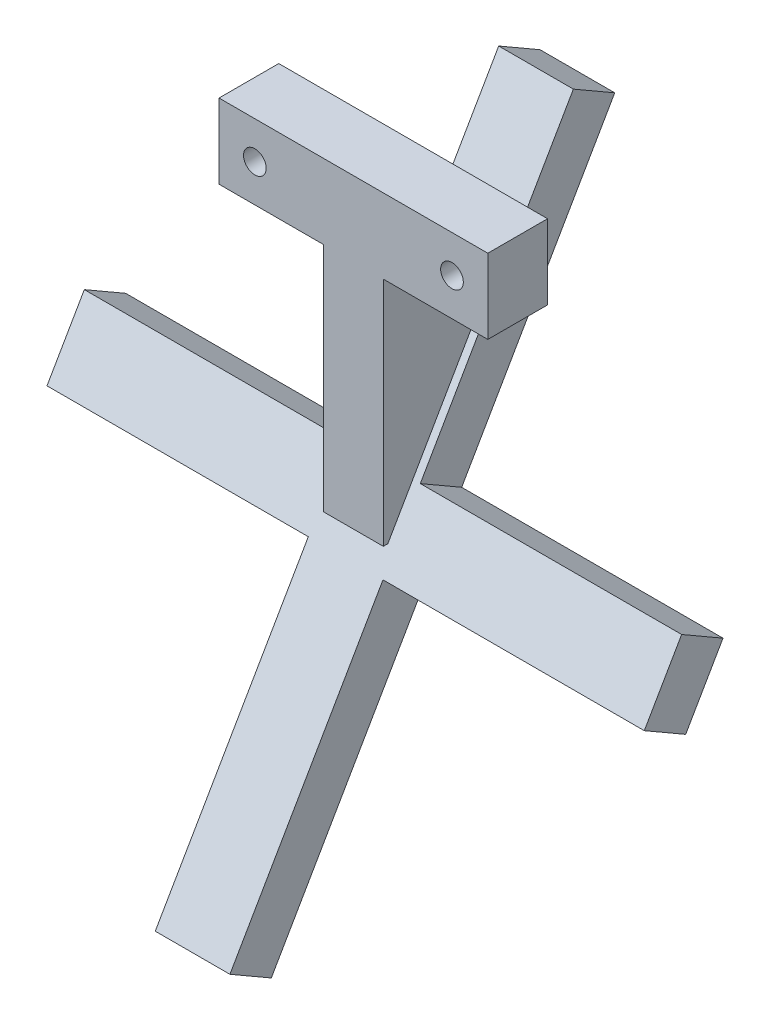
ISO-10303-21;
HEADER;
FILE_DESCRIPTION(('STEP AP214'),'2;1');
FILE_NAME('part.step','',(''),(''),'','','');
FILE_SCHEMA(('AUTOMOTIVE_DESIGN { 1 0 10303 214 1 1 1 1 }'));
ENDSEC;
DATA;
#1=APPLICATION_CONTEXT('core data for automotive mechanical design processes');
#2=APPLICATION_PROTOCOL_DEFINITION('international standard','automotive_design',2000,#1);
#3=PRODUCT_CONTEXT('',#1,'mechanical');
#4=PRODUCT('Part','Part','',(#3));
#5=PRODUCT_RELATED_PRODUCT_CATEGORY('part','',(#4));
#6=PRODUCT_DEFINITION_FORMATION('','',#4);
#7=PRODUCT_DEFINITION_CONTEXT('part definition',#1,'design');
#8=PRODUCT_DEFINITION('design','',#6,#7);
#9=PRODUCT_DEFINITION_SHAPE('','',#8);
#10=(LENGTH_UNIT() NAMED_UNIT(*) SI_UNIT(.MILLI.,.METRE.));
#11=(NAMED_UNIT(*) PLANE_ANGLE_UNIT() SI_UNIT($,.RADIAN.));
#12=(NAMED_UNIT(*) SI_UNIT($,.STERADIAN.) SOLID_ANGLE_UNIT());
#13=UNCERTAINTY_MEASURE_WITH_UNIT(LENGTH_MEASURE(1.E-05),#10,'distance_accuracy_value','');
#14=(GEOMETRIC_REPRESENTATION_CONTEXT(3) GLOBAL_UNCERTAINTY_ASSIGNED_CONTEXT((#13)) GLOBAL_UNIT_ASSIGNED_CONTEXT((#10,
#11,#12)) REPRESENTATION_CONTEXT('',''));
#15=CARTESIAN_POINT('',(0.,0.,0.));
#16=DIRECTION('',(0.,0.,1.));
#17=DIRECTION('',(1.,0.,0.));
#18=AXIS2_PLACEMENT_3D('',#15,#16,#17);
#19=CARTESIAN_POINT('',(-22.5,-6.25,-17.5));
#20=DIRECTION('',(0.,-1.,0.));
#21=DIRECTION('',(0.,0.,-1.));
#22=AXIS2_PLACEMENT_3D('',#19,#20,#21);
#23=PLANE('',#22);
#24=DIRECTION('',(1.,0.,0.));
#25=VECTOR('',#24,1.);
#26=CARTESIAN_POINT('',(-22.5,-6.25,-17.5));
#27=LINE('',#26,#25);
#28=CARTESIAN_POINT('',(-22.5,-6.25,-17.5));
#29=VERTEX_POINT('',#28);
#30=CARTESIAN_POINT('',(-5.,-6.25,-17.5));
#31=VERTEX_POINT('',#30);
#32=EDGE_CURVE('E323',#29,#31,#27,.T.);
#33=ORIENTED_EDGE('',*,*,#32,.T.);
#34=DIRECTION('',(0.,0.,1.));
#35=VECTOR('',#34,1.);
#36=CARTESIAN_POINT('',(-5.,-6.25,-17.5));
#37=LINE('',#36,#35);
#38=CARTESIAN_POINT('',(-5.00000000000001,-6.25,-7.5));
#39=VERTEX_POINT('',#38);
#40=EDGE_CURVE('E260',#31,#39,#37,.T.);
#41=ORIENTED_EDGE('',*,*,#40,.T.);
#42=DIRECTION('',(1.,0.,0.));
#43=VECTOR('',#42,1.);
#44=CARTESIAN_POINT('',(-22.5,-6.25,-7.5));
#45=LINE('',#44,#43);
#46=CARTESIAN_POINT('',(-22.5,-6.25,-7.5));
#47=VERTEX_POINT('',#46);
#48=EDGE_CURVE('E311',#47,#39,#45,.T.);
#49=ORIENTED_EDGE('',*,*,#48,.F.);
#50=DIRECTION('',(0.,0.,-1.));
#51=VECTOR('',#50,1.);
#52=CARTESIAN_POINT('',(-22.5,-6.25,-17.5));
#53=LINE('',#52,#51);
#54=EDGE_CURVE('E294',#47,#29,#53,.T.);
#55=ORIENTED_EDGE('',*,*,#54,.T.);
#56=EDGE_LOOP('',(#33,#41,#49,#55));
#57=FACE_BOUND('',#56,.T.);
#58=ADVANCED_FACE('F39',(#57),#23,.T.);
#59=DIRECTION('',(0.,0.,1.));
#60=VECTOR('',#59,1.);
#61=CARTESIAN_POINT('',(5.,-6.25,-17.5));
#62=LINE('',#61,#60);
#63=CARTESIAN_POINT('',(5.,-6.25,-17.5));
#64=VERTEX_POINT('',#63);
#65=CARTESIAN_POINT('',(5.,-6.25,-7.5));
#66=VERTEX_POINT('',#65);
#67=EDGE_CURVE('E246',#64,#66,#62,.T.);
#68=ORIENTED_EDGE('',*,*,#67,.F.);
#69=CARTESIAN_POINT('',(22.5,-6.25,-17.5));
#70=VERTEX_POINT('',#69);
#71=EDGE_CURVE('E310',#64,#70,#27,.T.);
#72=ORIENTED_EDGE('',*,*,#71,.T.);
#73=DIRECTION('',(0.,0.,-1.));
#74=VECTOR('',#73,1.);
#75=CARTESIAN_POINT('',(22.5,-6.25,-17.5));
#76=LINE('',#75,#74);
#77=CARTESIAN_POINT('',(22.5,-6.25,-7.5));
#78=VERTEX_POINT('',#77);
#79=EDGE_CURVE('E278',#78,#70,#76,.T.);
#80=ORIENTED_EDGE('',*,*,#79,.F.);
#81=EDGE_CURVE('E316',#66,#78,#45,.T.);
#82=ORIENTED_EDGE('',*,*,#81,.F.);
#83=EDGE_LOOP('',(#68,#72,#80,#82));
#84=FACE_BOUND('',#83,.T.);
#85=ADVANCED_FACE('F343',(#84),#23,.T.);
#86=CARTESIAN_POINT('',(-22.5,6.25,-7.5));
#87=DIRECTION('',(0.,0.,1.));
#88=DIRECTION('',(1.,0.,0.));
#89=AXIS2_PLACEMENT_3D('',#86,#87,#88);
#90=PLANE('',#89);
#91=CARTESIAN_POINT('',(-16.5,0.,-7.5));
#92=DIRECTION('',(0.,0.,-1.));
#93=DIRECTION('',(-1.,0.,0.));
#94=AXIS2_PLACEMENT_3D('',#91,#92,#93);
#95=CIRCLE('',#94,1.89864999999999);
#96=CARTESIAN_POINT('',(-18.39865,0.,-7.5));
#97=VERTEX_POINT('',#96);
#98=EDGE_CURVE('E234',#97,#97,#95,.T.);
#99=ORIENTED_EDGE('',*,*,#98,.T.);
#100=EDGE_LOOP('',(#99));
#101=FACE_BOUND('',#100,.T.);
#102=CARTESIAN_POINT('',(16.5,0.,-7.5));
#103=DIRECTION('',(0.,0.,-1.));
#104=DIRECTION('',(-1.,0.,0.));
#105=AXIS2_PLACEMENT_3D('',#102,#103,#104);
#106=CIRCLE('',#105,1.89864999999999);
#107=CARTESIAN_POINT('',(14.60135,0.,-7.5));
#108=VERTEX_POINT('',#107);
#109=EDGE_CURVE('E242',#108,#108,#106,.T.);
#110=ORIENTED_EDGE('',*,*,#109,.T.);
#111=EDGE_LOOP('',(#110));
#112=FACE_BOUND('',#111,.T.);
#113=ORIENTED_EDGE('',*,*,#48,.T.);
#114=DIRECTION('',(0.,-1.,0.));
#115=VECTOR('',#114,1.);
#116=CARTESIAN_POINT('',(-5.,-6.25,-7.5));
#117=LINE('',#116,#115);
#118=CARTESIAN_POINT('',(-5.,-45.,-7.50000000000001));
#119=VERTEX_POINT('',#118);
#120=EDGE_CURVE('E264',#39,#119,#117,.T.);
#121=ORIENTED_EDGE('',*,*,#120,.T.);
#122=DIRECTION('',(1.,0.,0.));
#123=VECTOR('',#122,1.);
#124=CARTESIAN_POINT('',(-5.,-45.,-7.50000000000001));
#125=LINE('',#124,#123);
#126=CARTESIAN_POINT('',(5.,-45.,-7.50000000000001));
#127=VERTEX_POINT('',#126);
#128=EDGE_CURVE('E275',#119,#127,#125,.T.);
#129=ORIENTED_EDGE('',*,*,#128,.T.);
#130=DIRECTION('',(0.,-1.,0.));
#131=VECTOR('',#130,1.);
#132=CARTESIAN_POINT('',(5.,-6.25,-7.5));
#133=LINE('',#132,#131);
#134=EDGE_CURVE('E250',#66,#127,#133,.T.);
#135=ORIENTED_EDGE('',*,*,#134,.F.);
#136=ORIENTED_EDGE('',*,*,#81,.T.);
#137=DIRECTION('',(0.,-1.,0.));
#138=VECTOR('',#137,1.);
#139=CARTESIAN_POINT('',(22.5,6.25,-7.5));
#140=LINE('',#139,#138);
#141=CARTESIAN_POINT('',(22.5,6.25,-7.5));
#142=VERTEX_POINT('',#141);
#143=EDGE_CURVE('E290',#142,#78,#140,.T.);
#144=ORIENTED_EDGE('',*,*,#143,.F.);
#145=DIRECTION('',(1.,0.,0.));
#146=VECTOR('',#145,1.);
#147=CARTESIAN_POINT('',(-22.5,6.25,-7.5));
#148=LINE('',#147,#146);
#149=CARTESIAN_POINT('',(-22.5,6.25,-7.5));
#150=VERTEX_POINT('',#149);
#151=EDGE_CURVE('E317',#150,#142,#148,.T.);
#152=ORIENTED_EDGE('',*,*,#151,.F.);
#153=DIRECTION('',(0.,-1.,0.));
#154=VECTOR('',#153,1.);
#155=CARTESIAN_POINT('',(-22.5,6.25,-7.5));
#156=LINE('',#155,#154);
#157=EDGE_CURVE('E306',#150,#47,#156,.T.);
#158=ORIENTED_EDGE('',*,*,#157,.T.);
#159=EDGE_LOOP('',(#113,#121,#129,#135,#136,#144,#152,#158));
#160=FACE_BOUND('',#159,.T.);
#161=ADVANCED_FACE('F352',(#101,#112,#160),#90,.T.);
#162=CARTESIAN_POINT('',(-22.5,6.25,-17.5));
#163=DIRECTION('',(0.,1.,0.));
#164=DIRECTION('',(0.,0.,1.));
#165=AXIS2_PLACEMENT_3D('',#162,#163,#164);
#166=PLANE('',#165);
#167=ORIENTED_EDGE('',*,*,#151,.T.);
#168=DIRECTION('',(0.,0.,1.));
#169=VECTOR('',#168,1.);
#170=CARTESIAN_POINT('',(22.5,6.25,-17.5));
#171=LINE('',#170,#169);
#172=CARTESIAN_POINT('',(22.5,6.25,-17.5));
#173=VERTEX_POINT('',#172);
#174=EDGE_CURVE('E286',#173,#142,#171,.T.);
#175=ORIENTED_EDGE('',*,*,#174,.F.);
#176=DIRECTION('',(1.,0.,0.));
#177=VECTOR('',#176,1.);
#178=CARTESIAN_POINT('',(-22.5,6.25,-17.5));
#179=LINE('',#178,#177);
#180=CARTESIAN_POINT('',(-22.5,6.25,-17.5));
#181=VERTEX_POINT('',#180);
#182=EDGE_CURVE('E320',#181,#173,#179,.T.);
#183=ORIENTED_EDGE('',*,*,#182,.F.);
#184=DIRECTION('',(0.,0.,1.));
#185=VECTOR('',#184,1.);
#186=CARTESIAN_POINT('',(-22.5,6.25,-17.5));
#187=LINE('',#186,#185);
#188=EDGE_CURVE('E302',#181,#150,#187,.T.);
#189=ORIENTED_EDGE('',*,*,#188,.T.);
#190=EDGE_LOOP('',(#167,#175,#183,#189));
#191=FACE_BOUND('',#190,.T.);
#192=ADVANCED_FACE('F391',(#191),#166,.T.);
#193=CARTESIAN_POINT('',(-22.5,-6.25,-17.5));
#194=DIRECTION('',(0.,0.,-1.));
#195=DIRECTION('',(-1.,0.,0.));
#196=AXIS2_PLACEMENT_3D('',#193,#194,#195);
#197=PLANE('',#196);
#198=DIRECTION('',(0.,1.,0.));
#199=VECTOR('',#198,1.);
#200=CARTESIAN_POINT('',(5.,-6.25,-17.5));
#201=LINE('',#200,#199);
#202=CARTESIAN_POINT('',(5.,-10.3397459621554,-17.5));
#203=VERTEX_POINT('',#202);
#204=EDGE_CURVE('E257',#203,#64,#201,.T.);
#205=ORIENTED_EDGE('',*,*,#204,.F.);
#206=DIRECTION('',(1.,0.,0.));
#207=VECTOR('',#206,1.);
#208=CARTESIAN_POINT('',(-5.,-10.3397459621554,-17.5));
#209=LINE('',#208,#207);
#210=CARTESIAN_POINT('',(-5.,-10.3397459621554,-17.5));
#211=VERTEX_POINT('',#210);
#212=EDGE_CURVE('E61',#203,#211,#209,.F.);
#213=ORIENTED_EDGE('',*,*,#212,.T.);
#214=DIRECTION('',(0.,1.,0.));
#215=VECTOR('',#214,1.);
#216=CARTESIAN_POINT('',(-5.,-6.25,-17.5));
#217=LINE('',#216,#215);
#218=EDGE_CURVE('E272',#211,#31,#217,.T.);
#219=ORIENTED_EDGE('',*,*,#218,.T.);
#220=ORIENTED_EDGE('',*,*,#32,.F.);
#221=DIRECTION('',(0.,1.,0.));
#222=VECTOR('',#221,1.);
#223=CARTESIAN_POINT('',(-22.5,-6.25,-17.5));
#224=LINE('',#223,#222);
#225=EDGE_CURVE('E298',#29,#181,#224,.T.);
#226=ORIENTED_EDGE('',*,*,#225,.T.);
#227=ORIENTED_EDGE('',*,*,#182,.T.);
#228=DIRECTION('',(0.,1.,0.));
#229=VECTOR('',#228,1.);
#230=CARTESIAN_POINT('',(22.5,-6.25,-17.5));
#231=LINE('',#230,#229);
#232=EDGE_CURVE('E282',#70,#173,#231,.T.);
#233=ORIENTED_EDGE('',*,*,#232,.F.);
#234=ORIENTED_EDGE('',*,*,#71,.F.);
#235=EDGE_LOOP('',(#205,#213,#219,#220,#226,#227,#233,#234));
#236=FACE_BOUND('',#235,.T.);
#237=CARTESIAN_POINT('',(-16.5,0.,-17.5));
#238=DIRECTION('',(0.,0.,-1.));
#239=DIRECTION('',(-1.,0.,0.));
#240=AXIS2_PLACEMENT_3D('',#237,#238,#239);
#241=CIRCLE('',#240,1.89864999999999);
#242=CARTESIAN_POINT('',(-18.39865,0.,-17.5));
#243=VERTEX_POINT('',#242);
#244=EDGE_CURVE('E230',#243,#243,#241,.T.);
#245=ORIENTED_EDGE('',*,*,#244,.F.);
#246=EDGE_LOOP('',(#245));
#247=FACE_BOUND('',#246,.T.);
#248=CARTESIAN_POINT('',(16.5,0.,-17.5));
#249=DIRECTION('',(0.,0.,-1.));
#250=DIRECTION('',(-1.,0.,0.));
#251=AXIS2_PLACEMENT_3D('',#248,#249,#250);
#252=CIRCLE('',#251,1.89864999999999);
#253=CARTESIAN_POINT('',(14.60135,0.,-17.5));
#254=VERTEX_POINT('',#253);
#255=EDGE_CURVE('E238',#254,#254,#252,.T.);
#256=ORIENTED_EDGE('',*,*,#255,.F.);
#257=EDGE_LOOP('',(#256));
#258=FACE_BOUND('',#257,.T.);
#259=ADVANCED_FACE('F345',(#236,#247,#258),#197,.T.);
#260=CARTESIAN_POINT('',(-22.5,0.,0.));
#261=DIRECTION('',(1.,0.,0.));
#262=DIRECTION('',(0.,0.,-1.));
#263=AXIS2_PLACEMENT_3D('',#260,#261,#262);
#264=PLANE('',#263);
#265=ORIENTED_EDGE('',*,*,#54,.F.);
#266=ORIENTED_EDGE('',*,*,#157,.F.);
#267=ORIENTED_EDGE('',*,*,#188,.F.);
#268=ORIENTED_EDGE('',*,*,#225,.F.);
#269=EDGE_LOOP('',(#265,#266,#267,#268));
#270=FACE_BOUND('',#269,.T.);
#271=ADVANCED_FACE('F367',(#270),#264,.F.);
#272=CARTESIAN_POINT('',(22.5,0.,0.));
#273=DIRECTION('',(1.,0.,0.));
#274=DIRECTION('',(0.,0.,-1.));
#275=AXIS2_PLACEMENT_3D('',#272,#273,#274);
#276=PLANE('',#275);
#277=ORIENTED_EDGE('',*,*,#79,.T.);
#278=ORIENTED_EDGE('',*,*,#232,.T.);
#279=ORIENTED_EDGE('',*,*,#174,.T.);
#280=ORIENTED_EDGE('',*,*,#143,.T.);
#281=EDGE_LOOP('',(#277,#278,#279,#280));
#282=FACE_BOUND('',#281,.T.);
#283=ADVANCED_FACE('F349',(#282),#276,.T.);
#284=CARTESIAN_POINT('',(-5.,-45.,-7.50000000000001));
#285=DIRECTION('',(0.,-1.,0.));
#286=DIRECTION('',(0.,0.,-1.));
#287=AXIS2_PLACEMENT_3D('',#284,#285,#286);
#288=PLANE('',#287);
#289=DIRECTION('',(-1.,0.,0.));
#290=VECTOR('',#289,1.);
#291=CARTESIAN_POINT('',(-5.,-45.,-8.26239569296598));
#292=LINE('',#291,#290);
#293=CARTESIAN_POINT('',(5.,-45.,-8.26239569296598));
#294=VERTEX_POINT('',#293);
#295=CARTESIAN_POINT('',(-5.,-45.,-8.26239569296598));
#296=VERTEX_POINT('',#295);
#297=EDGE_CURVE('E217',#294,#296,#292,.T.);
#298=ORIENTED_EDGE('',*,*,#297,.F.);
#299=DIRECTION('',(0.,0.,-1.));
#300=VECTOR('',#299,1.);
#301=CARTESIAN_POINT('',(5.,-45.,-7.50000000000001));
#302=LINE('',#301,#300);
#303=EDGE_CURVE('E254',#127,#294,#302,.T.);
#304=ORIENTED_EDGE('',*,*,#303,.F.);
#305=ORIENTED_EDGE('',*,*,#128,.F.);
#306=DIRECTION('',(0.,0.,-1.));
#307=VECTOR('',#306,1.);
#308=CARTESIAN_POINT('',(-5.,-45.,-7.50000000000001));
#309=LINE('',#308,#307);
#310=EDGE_CURVE('E268',#119,#296,#309,.T.);
#311=ORIENTED_EDGE('',*,*,#310,.T.);
#312=EDGE_LOOP('',(#298,#304,#305,#311));
#313=FACE_BOUND('',#312,.T.);
#314=ADVANCED_FACE('F371',(#313),#288,.T.);
#315=CARTESIAN_POINT('',(-5.,0.,0.));
#316=DIRECTION('',(1.,0.,0.));
#317=DIRECTION('',(0.,0.,-1.));
#318=AXIS2_PLACEMENT_3D('',#315,#316,#317);
#319=PLANE('',#318);
#320=ORIENTED_EDGE('',*,*,#218,.F.);
#321=CARTESIAN_POINT('',(-5.,-10.3397459621554,-22.5));
#322=DIRECTION('',(1.,0.,0.));
#323=DIRECTION('',(0.,0.,-1.));
#324=AXIS2_PLACEMENT_3D('',#321,#322,#323);
#325=CIRCLE('',#324,5.);
#326=CARTESIAN_POINT('',(-5.,-12.8397459621554,-26.8301270189222));
#327=VERTEX_POINT('',#326);
#328=EDGE_CURVE('E11',#211,#327,#325,.T.);
#329=ORIENTED_EDGE('',*,*,#328,.T.);
#330=DIRECTION('',(0.,-0.86602540378444,0.499999999999998));
#331=VECTOR('',#330,1.);
#332=CARTESIAN_POINT('',(-5.,-14.8277222831137,-25.6823683548743));
#333=LINE('',#332,#331);
#334=EDGE_CURVE('E222',#327,#296,#333,.T.);
#335=ORIENTED_EDGE('',*,*,#334,.T.);
#336=ORIENTED_EDGE('',*,*,#310,.F.);
#337=ORIENTED_EDGE('',*,*,#120,.F.);
#338=ORIENTED_EDGE('',*,*,#40,.F.);
#339=EDGE_LOOP('',(#320,#329,#335,#336,#337,#338));
#340=FACE_BOUND('',#339,.T.);
#341=ADVANCED_FACE('F359',(#340),#319,.F.);
#342=CARTESIAN_POINT('',(5.,0.,0.));
#343=DIRECTION('',(1.,0.,0.));
#344=DIRECTION('',(0.,0.,-1.));
#345=AXIS2_PLACEMENT_3D('',#342,#343,#344);
#346=PLANE('',#345);
#347=DIRECTION('',(0.,-0.86602540378444,0.499999999999998));
#348=VECTOR('',#347,1.);
#349=CARTESIAN_POINT('',(5.,-14.8277222831137,-25.6823683548743));
#350=LINE('',#349,#348);
#351=CARTESIAN_POINT('',(5.,-12.8397459621554,-26.8301270189222));
#352=VERTEX_POINT('',#351);
#353=EDGE_CURVE('E315',#352,#294,#350,.T.);
#354=ORIENTED_EDGE('',*,*,#353,.F.);
#355=CARTESIAN_POINT('',(5.,-10.3397459621554,-22.5));
#356=DIRECTION('',(1.,0.,0.));
#357=DIRECTION('',(0.,0.,-1.));
#358=AXIS2_PLACEMENT_3D('',#355,#356,#357);
#359=CIRCLE('',#358,5.);
#360=EDGE_CURVE('E48',#352,#203,#359,.F.);
#361=ORIENTED_EDGE('',*,*,#360,.T.);
#362=ORIENTED_EDGE('',*,*,#204,.T.);
#363=ORIENTED_EDGE('',*,*,#67,.T.);
#364=ORIENTED_EDGE('',*,*,#134,.T.);
#365=ORIENTED_EDGE('',*,*,#303,.T.);
#366=EDGE_LOOP('',(#354,#361,#362,#363,#364,#365));
#367=FACE_BOUND('',#366,.T.);
#368=ADVANCED_FACE('F354',(#367),#346,.T.);
#369=CARTESIAN_POINT('',(16.5,0.,-17.5));
#370=DIRECTION('',(0.,0.,-1.));
#371=DIRECTION('',(-1.,0.,0.));
#372=AXIS2_PLACEMENT_3D('',#369,#370,#371);
#373=CYLINDRICAL_SURFACE('',#372,1.89864999999999);
#374=ORIENTED_EDGE('',*,*,#109,.F.);
#375=EDGE_LOOP('',(#374));
#376=FACE_BOUND('',#375,.T.);
#377=ORIENTED_EDGE('',*,*,#255,.T.);
#378=EDGE_LOOP('',(#377));
#379=FACE_BOUND('',#378,.T.);
#380=ADVANCED_FACE('F380',(#376,#379),#373,.F.);
#381=CARTESIAN_POINT('',(-16.5,0.,-17.5));
#382=DIRECTION('',(0.,0.,-1.));
#383=DIRECTION('',(-1.,0.,0.));
#384=AXIS2_PLACEMENT_3D('',#381,#382,#383);
#385=CYLINDRICAL_SURFACE('',#384,1.89864999999999);
#386=ORIENTED_EDGE('',*,*,#98,.F.);
#387=EDGE_LOOP('',(#386));
#388=FACE_BOUND('',#387,.T.);
#389=ORIENTED_EDGE('',*,*,#244,.T.);
#390=EDGE_LOOP('',(#389));
#391=FACE_BOUND('',#390,.T.);
#392=ADVANCED_FACE('F373',(#388,#391),#385,.F.);
#393=CARTESIAN_POINT('',(0.,-14.8277222831137,-25.6823683548743));
#394=DIRECTION('',(0.,0.499999999999998,0.86602540378444));
#395=DIRECTION('',(0.,-0.86602540378444,0.499999999999998));
#396=AXIS2_PLACEMENT_3D('',#393,#394,#395);
#397=PLANE('',#396);
#398=DIRECTION('',(0.,-0.86602540378444,0.499999999999998));
#399=VECTOR('',#398,1.);
#400=CARTESIAN_POINT('',(-6.24999999999999,-48.5777222831139,-6.19679676972449));
#401=LINE('',#400,#399);
#402=CARTESIAN_POINT('',(-6.24999999999999,-48.5777222831139,-6.19679676972449));
#403=VERTEX_POINT('',#402);
#404=CARTESIAN_POINT('',(-6.25000000000001,-92.9615242270664,19.4282032302754));
#405=VERTEX_POINT('',#404);
#406=EDGE_CURVE('E200',#403,#405,#401,.T.);
#407=ORIENTED_EDGE('',*,*,#406,.T.);
#408=DIRECTION('',(1.,0.,0.));
#409=VECTOR('',#408,1.);
#410=CARTESIAN_POINT('',(-6.25000000000001,-92.9615242270664,19.4282032302754));
#411=LINE('',#410,#409);
#412=CARTESIAN_POINT('',(6.25000000000001,-92.9615242270664,19.4282032302754));
#413=VERTEX_POINT('',#412);
#414=EDGE_CURVE('E188',#405,#413,#411,.T.);
#415=ORIENTED_EDGE('',*,*,#414,.T.);
#416=DIRECTION('',(0.,0.86602540378444,-0.499999999999998));
#417=VECTOR('',#416,1.);
#418=CARTESIAN_POINT('',(6.24999999999999,-48.5777222831139,-6.19679676972449));
#419=LINE('',#418,#417);
#420=CARTESIAN_POINT('',(6.24999999999999,-48.5777222831139,-6.19679676972449));
#421=VERTEX_POINT('',#420);
#422=EDGE_CURVE('E199',#413,#421,#419,.T.);
#423=ORIENTED_EDGE('',*,*,#422,.T.);
#424=DIRECTION('',(1.,0.,0.));
#425=VECTOR('',#424,1.);
#426=CARTESIAN_POINT('',(50.,-48.5777222831139,-6.19679676972449));
#427=LINE('',#426,#425);
#428=CARTESIAN_POINT('',(50.,-48.5777222831139,-6.19679676972449));
#429=VERTEX_POINT('',#428);
#430=EDGE_CURVE('E538',#421,#429,#427,.T.);
#431=ORIENTED_EDGE('',*,*,#430,.T.);
#432=DIRECTION('',(0.,0.86602540378444,-0.499999999999998));
#433=VECTOR('',#432,1.);
#434=CARTESIAN_POINT('',(50.,-37.7524047358083,-12.4467967697245));
#435=LINE('',#434,#433);
#436=CARTESIAN_POINT('',(50.,-37.7524047358083,-12.4467967697245));
#437=VERTEX_POINT('',#436);
#438=EDGE_CURVE('E550',#429,#437,#435,.T.);
#439=ORIENTED_EDGE('',*,*,#438,.T.);
#440=DIRECTION('',(-1.,0.,0.));
#441=VECTOR('',#440,1.);
#442=CARTESIAN_POINT('',(50.,-37.7524047358083,-12.4467967697245));
#443=LINE('',#442,#441);
#444=CARTESIAN_POINT('',(6.24999999999999,-37.7524047358083,-12.4467967697245));
#445=VERTEX_POINT('',#444);
#446=EDGE_CURVE('E546',#437,#445,#443,.T.);
#447=ORIENTED_EDGE('',*,*,#446,.T.);
#448=DIRECTION('',(0.,0.86602540378444,-0.499999999999998));
#449=VECTOR('',#448,1.);
#450=CARTESIAN_POINT('',(6.24999999999999,-37.7524047358083,-12.4467967697245));
#451=LINE('',#450,#449);
#452=CARTESIAN_POINT('',(6.25000000000001,6.63139720814417,-38.0717967697244));
#453=VERTEX_POINT('',#452);
#454=EDGE_CURVE('E549',#445,#453,#451,.T.);
#455=ORIENTED_EDGE('',*,*,#454,.T.);
#456=DIRECTION('',(-1.,0.,0.));
#457=VECTOR('',#456,1.);
#458=CARTESIAN_POINT('',(-6.25000000000001,6.63139720814417,-38.0717967697244));
#459=LINE('',#458,#457);
#460=CARTESIAN_POINT('',(-6.25000000000001,6.63139720814417,-38.0717967697244));
#461=VERTEX_POINT('',#460);
#462=EDGE_CURVE('E554',#453,#461,#459,.T.);
#463=ORIENTED_EDGE('',*,*,#462,.T.);
#464=DIRECTION('',(0.,-0.86602540378444,0.499999999999998));
#465=VECTOR('',#464,1.);
#466=CARTESIAN_POINT('',(-6.24999999999999,-37.7524047358083,-12.4467967697245));
#467=LINE('',#466,#465);
#468=CARTESIAN_POINT('',(-6.24999999999999,-37.7524047358083,-12.4467967697245));
#469=VERTEX_POINT('',#468);
#470=EDGE_CURVE('E561',#461,#469,#467,.T.);
#471=ORIENTED_EDGE('',*,*,#470,.T.);
#472=DIRECTION('',(-1.,0.,0.));
#473=VECTOR('',#472,1.);
#474=CARTESIAN_POINT('',(-50.,-37.7524047358083,-12.4467967697245));
#475=LINE('',#474,#473);
#476=CARTESIAN_POINT('',(-50.,-37.7524047358083,-12.4467967697245));
#477=VERTEX_POINT('',#476);
#478=EDGE_CURVE('E564',#469,#477,#475,.T.);
#479=ORIENTED_EDGE('',*,*,#478,.T.);
#480=DIRECTION('',(0.,-0.86602540378444,0.499999999999998));
#481=VECTOR('',#480,1.);
#482=CARTESIAN_POINT('',(-50.,-37.7524047358083,-12.4467967697245));
#483=LINE('',#482,#481);
#484=CARTESIAN_POINT('',(-50.,-48.5777222831139,-6.19679676972449));
#485=VERTEX_POINT('',#484);
#486=EDGE_CURVE('E566',#477,#485,#483,.T.);
#487=ORIENTED_EDGE('',*,*,#486,.T.);
#488=DIRECTION('',(1.,0.,0.));
#489=VECTOR('',#488,1.);
#490=CARTESIAN_POINT('',(-50.,-48.5777222831139,-6.19679676972449));
#491=LINE('',#490,#489);
#492=EDGE_CURVE('E206',#485,#403,#491,.T.);
#493=ORIENTED_EDGE('',*,*,#492,.T.);
#494=EDGE_LOOP('',(#407,#415,#423,#431,#439,#447,#455,#463,#471,#479,#487,#493));
#495=FACE_BOUND('',#494,.T.);
#496=DIRECTION('',(1.,0.,0.));
#497=VECTOR('',#496,1.);
#498=CARTESIAN_POINT('',(5.,-12.8397459621554,-26.8301270189222));
#499=LINE('',#498,#497);
#500=EDGE_CURVE('E330',#327,#352,#499,.T.);
#501=ORIENTED_EDGE('',*,*,#500,.T.);
#502=ORIENTED_EDGE('',*,*,#353,.T.);
#503=ORIENTED_EDGE('',*,*,#297,.T.);
#504=ORIENTED_EDGE('',*,*,#334,.F.);
#505=EDGE_LOOP('',(#501,#502,#503,#504));
#506=FACE_BOUND('',#505,.T.);
#507=ADVANCED_FACE('F203',(#495,#506),#397,.T.);
#508=CARTESIAN_POINT('',(-6.24999999999999,-48.5777222831139,-6.19679676972449));
#509=DIRECTION('',(1.,0.,0.));
#510=DIRECTION('',(0.,1.,0.));
#511=AXIS2_PLACEMENT_3D('',#508,#509,#510);
#512=PLANE('',#511);
#513=DIRECTION('',(0.,-0.86602540378444,0.499999999999998));
#514=VECTOR('',#513,1.);
#515=CARTESIAN_POINT('',(-6.24999999999999,-52.5777222831139,-13.125));
#516=LINE('',#515,#514);
#517=CARTESIAN_POINT('',(-6.24999999999999,-52.5777222831139,-13.125));
#518=VERTEX_POINT('',#517);
#519=CARTESIAN_POINT('',(-6.25000000000001,-96.9615242270664,12.4999999999999));
#520=VERTEX_POINT('',#519);
#521=EDGE_CURVE('E215',#518,#520,#516,.T.);
#522=ORIENTED_EDGE('',*,*,#521,.T.);
#523=DIRECTION('',(0.,-0.499999999999998,-0.86602540378444));
#524=VECTOR('',#523,1.);
#525=CARTESIAN_POINT('',(-6.25000000000001,-92.9615242270664,19.4282032302754));
#526=LINE('',#525,#524);
#527=EDGE_CURVE('E192',#405,#520,#526,.T.);
#528=ORIENTED_EDGE('',*,*,#527,.F.);
#529=ORIENTED_EDGE('',*,*,#406,.F.);
#530=DIRECTION('',(0.,-0.499999999999998,-0.86602540378444));
#531=VECTOR('',#530,1.);
#532=CARTESIAN_POINT('',(-6.24999999999999,-48.5777222831139,-6.19679676972449));
#533=LINE('',#532,#531);
#534=EDGE_CURVE('E498',#403,#518,#533,.T.);
#535=ORIENTED_EDGE('',*,*,#534,.T.);
#536=EDGE_LOOP('',(#522,#528,#529,#535));
#537=FACE_BOUND('',#536,.T.);
#538=ADVANCED_FACE('F213',(#537),#512,.F.);
#539=CARTESIAN_POINT('',(-6.25000000000001,-92.9615242270664,19.4282032302754));
#540=DIRECTION('',(0.,0.86602540378444,-0.499999999999998));
#541=DIRECTION('',(0.,0.499999999999998,0.86602540378444));
#542=AXIS2_PLACEMENT_3D('',#539,#540,#541);
#543=PLANE('',#542);
#544=DIRECTION('',(1.,0.,0.));
#545=VECTOR('',#544,1.);
#546=CARTESIAN_POINT('',(-6.25000000000001,-96.9615242270664,12.4999999999999));
#547=LINE('',#546,#545);
#548=CARTESIAN_POINT('',(6.25000000000001,-96.9615242270664,12.4999999999999));
#549=VERTEX_POINT('',#548);
#550=EDGE_CURVE('E461',#520,#549,#547,.T.);
#551=ORIENTED_EDGE('',*,*,#550,.T.);
#552=DIRECTION('',(0.,-0.499999999999998,-0.86602540378444));
#553=VECTOR('',#552,1.);
#554=CARTESIAN_POINT('',(6.25000000000001,-92.9615242270664,19.4282032302754));
#555=LINE('',#554,#553);
#556=EDGE_CURVE('E195',#413,#549,#555,.T.);
#557=ORIENTED_EDGE('',*,*,#556,.F.);
#558=ORIENTED_EDGE('',*,*,#414,.F.);
#559=ORIENTED_EDGE('',*,*,#527,.T.);
#560=EDGE_LOOP('',(#551,#557,#558,#559));
#561=FACE_BOUND('',#560,.T.);
#562=ADVANCED_FACE('F190',(#561),#543,.F.);
#563=CARTESIAN_POINT('',(6.24999999999999,-48.5777222831139,-6.19679676972449));
#564=DIRECTION('',(-1.,0.,0.));
#565=DIRECTION('',(0.,-1.,0.));
#566=AXIS2_PLACEMENT_3D('',#563,#564,#565);
#567=PLANE('',#566);
#568=DIRECTION('',(0.,0.86602540378444,-0.499999999999998));
#569=VECTOR('',#568,1.);
#570=CARTESIAN_POINT('',(6.24999999999999,-52.5777222831139,-13.125));
#571=LINE('',#570,#569);
#572=CARTESIAN_POINT('',(6.24999999999999,-52.5777222831139,-13.125));
#573=VERTEX_POINT('',#572);
#574=EDGE_CURVE('E465',#549,#573,#571,.T.);
#575=ORIENTED_EDGE('',*,*,#574,.T.);
#576=DIRECTION('',(0.,-0.499999999999998,-0.86602540378444));
#577=VECTOR('',#576,1.);
#578=CARTESIAN_POINT('',(6.24999999999999,-48.5777222831139,-6.19679676972449));
#579=LINE('',#578,#577);
#580=EDGE_CURVE('E224',#421,#573,#579,.T.);
#581=ORIENTED_EDGE('',*,*,#580,.F.);
#582=ORIENTED_EDGE('',*,*,#422,.F.);
#583=ORIENTED_EDGE('',*,*,#556,.T.);
#584=EDGE_LOOP('',(#575,#581,#582,#583));
#585=FACE_BOUND('',#584,.T.);
#586=ADVANCED_FACE('F413',(#585),#567,.F.);
#587=CARTESIAN_POINT('',(50.,-48.5777222831139,-6.19679676972449));
#588=DIRECTION('',(0.,0.86602540378444,-0.499999999999998));
#589=DIRECTION('',(0.,0.499999999999998,0.86602540378444));
#590=AXIS2_PLACEMENT_3D('',#587,#588,#589);
#591=PLANE('',#590);
#592=DIRECTION('',(1.,0.,0.));
#593=VECTOR('',#592,1.);
#594=CARTESIAN_POINT('',(50.,-52.5777222831138,-13.125));
#595=LINE('',#594,#593);
#596=CARTESIAN_POINT('',(50.,-52.5777222831138,-13.125));
#597=VERTEX_POINT('',#596);
#598=EDGE_CURVE('E472',#573,#597,#595,.T.);
#599=ORIENTED_EDGE('',*,*,#598,.T.);
#600=DIRECTION('',(0.,-0.499999999999998,-0.86602540378444));
#601=VECTOR('',#600,1.);
#602=CARTESIAN_POINT('',(50.,-48.5777222831139,-6.19679676972449));
#603=LINE('',#602,#601);
#604=EDGE_CURVE('E529',#429,#597,#603,.T.);
#605=ORIENTED_EDGE('',*,*,#604,.F.);
#606=ORIENTED_EDGE('',*,*,#430,.F.);
#607=ORIENTED_EDGE('',*,*,#580,.T.);
#608=EDGE_LOOP('',(#599,#605,#606,#607));
#609=FACE_BOUND('',#608,.T.);
#610=ADVANCED_FACE('F416',(#609),#591,.F.);
#611=CARTESIAN_POINT('',(50.,-37.7524047358083,-12.4467967697245));
#612=DIRECTION('',(-1.,0.,0.));
#613=DIRECTION('',(0.,0.,1.));
#614=AXIS2_PLACEMENT_3D('',#611,#612,#613);
#615=PLANE('',#614);
#616=DIRECTION('',(0.,0.86602540378444,-0.499999999999998));
#617=VECTOR('',#616,1.);
#618=CARTESIAN_POINT('',(50.,-41.7524047358083,-19.375));
#619=LINE('',#618,#617);
#620=CARTESIAN_POINT('',(50.,-41.7524047358083,-19.375));
#621=VERTEX_POINT('',#620);
#622=EDGE_CURVE('E475',#597,#621,#619,.T.);
#623=ORIENTED_EDGE('',*,*,#622,.T.);
#624=DIRECTION('',(0.,-0.499999999999998,-0.86602540378444));
#625=VECTOR('',#624,1.);
#626=CARTESIAN_POINT('',(50.,-37.7524047358083,-12.4467967697245));
#627=LINE('',#626,#625);
#628=EDGE_CURVE('E525',#437,#621,#627,.T.);
#629=ORIENTED_EDGE('',*,*,#628,.F.);
#630=ORIENTED_EDGE('',*,*,#438,.F.);
#631=ORIENTED_EDGE('',*,*,#604,.T.);
#632=EDGE_LOOP('',(#623,#629,#630,#631));
#633=FACE_BOUND('',#632,.T.);
#634=ADVANCED_FACE('F420',(#633),#615,.F.);
#635=CARTESIAN_POINT('',(50.,-37.7524047358083,-12.4467967697245));
#636=DIRECTION('',(0.,-0.86602540378444,0.499999999999998));
#637=DIRECTION('',(0.,-0.499999999999998,-0.86602540378444));
#638=AXIS2_PLACEMENT_3D('',#635,#636,#637);
#639=PLANE('',#638);
#640=DIRECTION('',(-1.,0.,0.));
#641=VECTOR('',#640,1.);
#642=CARTESIAN_POINT('',(50.,-41.7524047358083,-19.375));
#643=LINE('',#642,#641);
#644=CARTESIAN_POINT('',(6.24999999999999,-41.7524047358083,-19.375));
#645=VERTEX_POINT('',#644);
#646=EDGE_CURVE('E478',#621,#645,#643,.T.);
#647=ORIENTED_EDGE('',*,*,#646,.T.);
#648=DIRECTION('',(0.,-0.499999999999998,-0.86602540378444));
#649=VECTOR('',#648,1.);
#650=CARTESIAN_POINT('',(6.24999999999999,-37.7524047358083,-12.4467967697245));
#651=LINE('',#650,#649);
#652=EDGE_CURVE('E521',#445,#645,#651,.T.);
#653=ORIENTED_EDGE('',*,*,#652,.F.);
#654=ORIENTED_EDGE('',*,*,#446,.F.);
#655=ORIENTED_EDGE('',*,*,#628,.T.);
#656=EDGE_LOOP('',(#647,#653,#654,#655));
#657=FACE_BOUND('',#656,.T.);
#658=ADVANCED_FACE('F424',(#657),#639,.F.);
#659=CARTESIAN_POINT('',(6.24999999999999,-37.7524047358083,-12.4467967697245));
#660=DIRECTION('',(-1.,0.,0.));
#661=DIRECTION('',(0.,-1.,0.));
#662=AXIS2_PLACEMENT_3D('',#659,#660,#661);
#663=PLANE('',#662);
#664=DIRECTION('',(0.,0.86602540378444,-0.499999999999998));
#665=VECTOR('',#664,1.);
#666=CARTESIAN_POINT('',(6.24999999999999,-41.7524047358083,-19.375));
#667=LINE('',#666,#665);
#668=CARTESIAN_POINT('',(6.25000000000001,2.63139720814419,-44.9999999999999));
#669=VERTEX_POINT('',#668);
#670=EDGE_CURVE('E481',#645,#669,#667,.T.);
#671=ORIENTED_EDGE('',*,*,#670,.T.);
#672=DIRECTION('',(0.,-0.499999999999998,-0.86602540378444));
#673=VECTOR('',#672,1.);
#674=CARTESIAN_POINT('',(6.25000000000001,6.63139720814417,-38.0717967697244));
#675=LINE('',#674,#673);
#676=EDGE_CURVE('E517',#453,#669,#675,.T.);
#677=ORIENTED_EDGE('',*,*,#676,.F.);
#678=ORIENTED_EDGE('',*,*,#454,.F.);
#679=ORIENTED_EDGE('',*,*,#652,.T.);
#680=EDGE_LOOP('',(#671,#677,#678,#679));
#681=FACE_BOUND('',#680,.T.);
#682=ADVANCED_FACE('F428',(#681),#663,.F.);
#683=CARTESIAN_POINT('',(-6.25000000000001,6.63139720814417,-38.0717967697244));
#684=DIRECTION('',(0.,-0.86602540378444,0.499999999999998));
#685=DIRECTION('',(0.,-0.499999999999998,-0.86602540378444));
#686=AXIS2_PLACEMENT_3D('',#683,#684,#685);
#687=PLANE('',#686);
#688=DIRECTION('',(-1.,0.,0.));
#689=VECTOR('',#688,1.);
#690=CARTESIAN_POINT('',(-6.25000000000001,2.63139720814419,-44.9999999999999));
#691=LINE('',#690,#689);
#692=CARTESIAN_POINT('',(-6.25000000000001,2.63139720814419,-44.9999999999999));
#693=VERTEX_POINT('',#692);
#694=EDGE_CURVE('E484',#669,#693,#691,.T.);
#695=ORIENTED_EDGE('',*,*,#694,.T.);
#696=DIRECTION('',(0.,-0.499999999999998,-0.86602540378444));
#697=VECTOR('',#696,1.);
#698=CARTESIAN_POINT('',(-6.25000000000001,6.63139720814417,-38.0717967697244));
#699=LINE('',#698,#697);
#700=EDGE_CURVE('E513',#461,#693,#699,.T.);
#701=ORIENTED_EDGE('',*,*,#700,.F.);
#702=ORIENTED_EDGE('',*,*,#462,.F.);
#703=ORIENTED_EDGE('',*,*,#676,.T.);
#704=EDGE_LOOP('',(#695,#701,#702,#703));
#705=FACE_BOUND('',#704,.T.);
#706=ADVANCED_FACE('F432',(#705),#687,.F.);
#707=CARTESIAN_POINT('',(-6.24999999999999,-37.7524047358083,-12.4467967697245));
#708=DIRECTION('',(1.,0.,0.));
#709=DIRECTION('',(0.,1.,0.));
#710=AXIS2_PLACEMENT_3D('',#707,#708,#709);
#711=PLANE('',#710);
#712=DIRECTION('',(0.,-0.86602540378444,0.499999999999998));
#713=VECTOR('',#712,1.);
#714=CARTESIAN_POINT('',(-6.24999999999999,-41.7524047358083,-19.375));
#715=LINE('',#714,#713);
#716=CARTESIAN_POINT('',(-6.24999999999999,-41.7524047358083,-19.375));
#717=VERTEX_POINT('',#716);
#718=EDGE_CURVE('E487',#693,#717,#715,.T.);
#719=ORIENTED_EDGE('',*,*,#718,.T.);
#720=DIRECTION('',(0.,-0.499999999999998,-0.86602540378444));
#721=VECTOR('',#720,1.);
#722=CARTESIAN_POINT('',(-6.24999999999999,-37.7524047358083,-12.4467967697245));
#723=LINE('',#722,#721);
#724=EDGE_CURVE('E509',#469,#717,#723,.T.);
#725=ORIENTED_EDGE('',*,*,#724,.F.);
#726=ORIENTED_EDGE('',*,*,#470,.F.);
#727=ORIENTED_EDGE('',*,*,#700,.T.);
#728=EDGE_LOOP('',(#719,#725,#726,#727));
#729=FACE_BOUND('',#728,.T.);
#730=ADVANCED_FACE('F436',(#729),#711,.F.);
#731=CARTESIAN_POINT('',(-50.,-37.7524047358083,-12.4467967697245));
#732=DIRECTION('',(0.,-0.86602540378444,0.499999999999998));
#733=DIRECTION('',(0.,-0.499999999999998,-0.86602540378444));
#734=AXIS2_PLACEMENT_3D('',#731,#732,#733);
#735=PLANE('',#734);
#736=DIRECTION('',(-1.,0.,0.));
#737=VECTOR('',#736,1.);
#738=CARTESIAN_POINT('',(-50.,-41.7524047358083,-19.375));
#739=LINE('',#738,#737);
#740=CARTESIAN_POINT('',(-50.,-41.7524047358083,-19.375));
#741=VERTEX_POINT('',#740);
#742=EDGE_CURVE('E490',#717,#741,#739,.T.);
#743=ORIENTED_EDGE('',*,*,#742,.T.);
#744=DIRECTION('',(0.,-0.499999999999998,-0.86602540378444));
#745=VECTOR('',#744,1.);
#746=CARTESIAN_POINT('',(-50.,-37.7524047358083,-12.4467967697245));
#747=LINE('',#746,#745);
#748=EDGE_CURVE('E505',#477,#741,#747,.T.);
#749=ORIENTED_EDGE('',*,*,#748,.F.);
#750=ORIENTED_EDGE('',*,*,#478,.F.);
#751=ORIENTED_EDGE('',*,*,#724,.T.);
#752=EDGE_LOOP('',(#743,#749,#750,#751));
#753=FACE_BOUND('',#752,.T.);
#754=ADVANCED_FACE('F440',(#753),#735,.F.);
#755=CARTESIAN_POINT('',(-50.,-37.7524047358083,-12.4467967697245));
#756=DIRECTION('',(1.,0.,0.));
#757=DIRECTION('',(0.,0.,-1.));
#758=AXIS2_PLACEMENT_3D('',#755,#756,#757);
#759=PLANE('',#758);
#760=DIRECTION('',(0.,-0.86602540378444,0.499999999999998));
#761=VECTOR('',#760,1.);
#762=CARTESIAN_POINT('',(-50.,-41.7524047358083,-19.375));
#763=LINE('',#762,#761);
#764=CARTESIAN_POINT('',(-50.,-52.5777222831138,-13.125));
#765=VERTEX_POINT('',#764);
#766=EDGE_CURVE('E493',#741,#765,#763,.T.);
#767=ORIENTED_EDGE('',*,*,#766,.T.);
#768=DIRECTION('',(0.,-0.499999999999998,-0.86602540378444));
#769=VECTOR('',#768,1.);
#770=CARTESIAN_POINT('',(-50.,-48.5777222831139,-6.19679676972449));
#771=LINE('',#770,#769);
#772=EDGE_CURVE('E501',#485,#765,#771,.T.);
#773=ORIENTED_EDGE('',*,*,#772,.F.);
#774=ORIENTED_EDGE('',*,*,#486,.F.);
#775=ORIENTED_EDGE('',*,*,#748,.T.);
#776=EDGE_LOOP('',(#767,#773,#774,#775));
#777=FACE_BOUND('',#776,.T.);
#778=ADVANCED_FACE('F444',(#777),#759,.F.);
#779=CARTESIAN_POINT('',(-50.,-48.5777222831139,-6.19679676972449));
#780=DIRECTION('',(0.,0.86602540378444,-0.499999999999998));
#781=DIRECTION('',(0.,0.499999999999998,0.86602540378444));
#782=AXIS2_PLACEMENT_3D('',#779,#780,#781);
#783=PLANE('',#782);
#784=DIRECTION('',(1.,0.,0.));
#785=VECTOR('',#784,1.);
#786=CARTESIAN_POINT('',(-50.,-52.5777222831138,-13.125));
#787=LINE('',#786,#785);
#788=EDGE_CURVE('E211',#765,#518,#787,.T.);
#789=ORIENTED_EDGE('',*,*,#788,.T.);
#790=ORIENTED_EDGE('',*,*,#534,.F.);
#791=ORIENTED_EDGE('',*,*,#492,.F.);
#792=ORIENTED_EDGE('',*,*,#772,.T.);
#793=EDGE_LOOP('',(#789,#790,#791,#792));
#794=FACE_BOUND('',#793,.T.);
#795=ADVANCED_FACE('F448',(#794),#783,.F.);
#796=CARTESIAN_POINT('',(0.,-18.8277222831137,-32.6105715851498));
#797=DIRECTION('',(0.,0.499999999999998,0.86602540378444));
#798=DIRECTION('',(0.,-0.86602540378444,0.499999999999998));
#799=AXIS2_PLACEMENT_3D('',#796,#797,#798);
#800=PLANE('',#799);
#801=ORIENTED_EDGE('',*,*,#521,.F.);
#802=ORIENTED_EDGE('',*,*,#788,.F.);
#803=ORIENTED_EDGE('',*,*,#766,.F.);
#804=ORIENTED_EDGE('',*,*,#742,.F.);
#805=ORIENTED_EDGE('',*,*,#718,.F.);
#806=ORIENTED_EDGE('',*,*,#694,.F.);
#807=ORIENTED_EDGE('',*,*,#670,.F.);
#808=ORIENTED_EDGE('',*,*,#646,.F.);
#809=ORIENTED_EDGE('',*,*,#622,.F.);
#810=ORIENTED_EDGE('',*,*,#598,.F.);
#811=ORIENTED_EDGE('',*,*,#574,.F.);
#812=ORIENTED_EDGE('',*,*,#550,.F.);
#813=EDGE_LOOP('',(#801,#802,#803,#804,#805,#806,#807,#808,#809,#810,#811,#812));
#814=FACE_BOUND('',#813,.T.);
#815=ADVANCED_FACE('F451',(#814),#800,.F.);
#816=CARTESIAN_POINT('',(0.,-10.3397459621554,-22.5));
#817=DIRECTION('',(-1.,0.,0.));
#818=DIRECTION('',(0.,0.,1.));
#819=AXIS2_PLACEMENT_3D('',#816,#817,#818);
#820=CYLINDRICAL_SURFACE('',#819,5.);
#821=ORIENTED_EDGE('',*,*,#328,.F.);
#822=ORIENTED_EDGE('',*,*,#212,.F.);
#823=ORIENTED_EDGE('',*,*,#360,.F.);
#824=ORIENTED_EDGE('',*,*,#500,.F.);
#825=EDGE_LOOP('',(#821,#822,#823,#824));
#826=FACE_BOUND('',#825,.T.);
#827=ADVANCED_FACE('F41',(#826),#820,.F.);
#828=CLOSED_SHELL('',(#58,#85,#161,#192,#259,#271,#283,#314,#341,#368,#380,#392,#507,#538,#562,
#586,#610,#634,#658,#682,#706,#730,#754,#778,#795,#815,#827));
#829=MANIFOLD_SOLID_BREP('B2',#828);
#830=ADVANCED_BREP_SHAPE_REPRESENTATION('',(#18,#829),#14);
#831=SHAPE_DEFINITION_REPRESENTATION(#9,#830);
ENDSEC;
END-ISO-10303-21;
